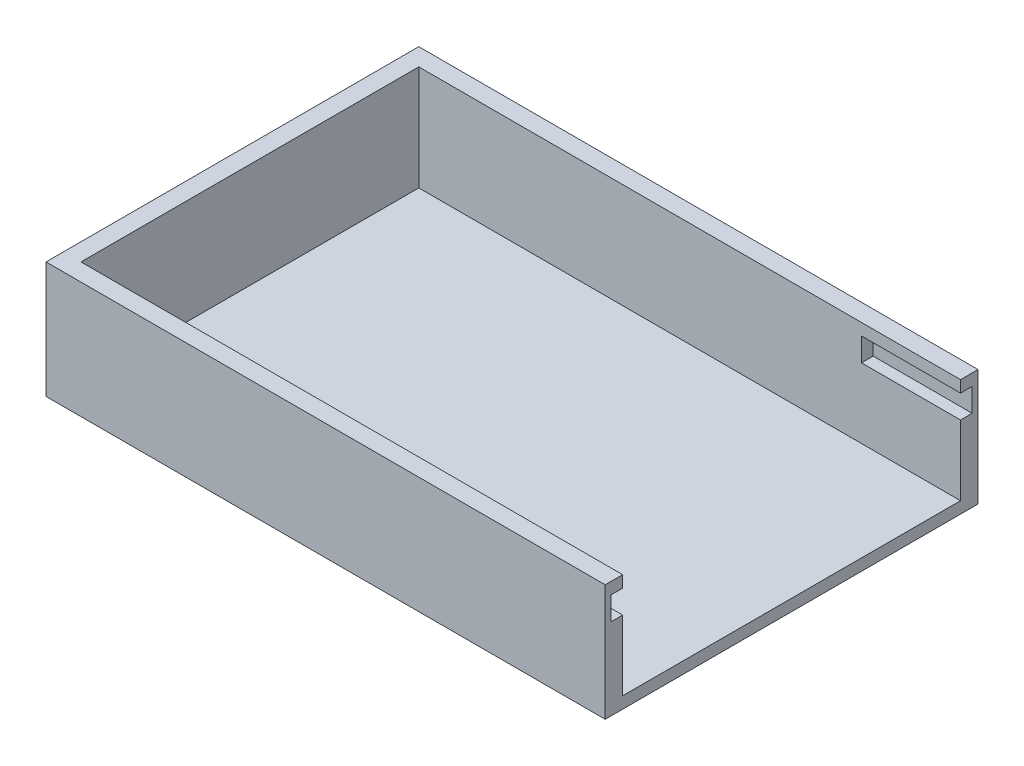
ISO-10303-21;
HEADER;
FILE_DESCRIPTION(('STEP AP214'),'2;1');
FILE_NAME('part.step','',(''),(''),'','','');
FILE_SCHEMA(('AUTOMOTIVE_DESIGN { 1 0 10303 214 1 1 1 1 }'));
ENDSEC;
DATA;
#1=APPLICATION_CONTEXT('core data for automotive mechanical design processes');
#2=APPLICATION_PROTOCOL_DEFINITION('international standard','automotive_design',2000,#1);
#3=PRODUCT_CONTEXT('',#1,'mechanical');
#4=PRODUCT('Part','Part','',(#3));
#5=PRODUCT_RELATED_PRODUCT_CATEGORY('part','',(#4));
#6=PRODUCT_DEFINITION_FORMATION('','',#4);
#7=PRODUCT_DEFINITION_CONTEXT('part definition',#1,'design');
#8=PRODUCT_DEFINITION('design','',#6,#7);
#9=PRODUCT_DEFINITION_SHAPE('','',#8);
#10=(LENGTH_UNIT() NAMED_UNIT(*) SI_UNIT(.MILLI.,.METRE.));
#11=(NAMED_UNIT(*) PLANE_ANGLE_UNIT() SI_UNIT($,.RADIAN.));
#12=(NAMED_UNIT(*) SI_UNIT($,.STERADIAN.) SOLID_ANGLE_UNIT());
#13=UNCERTAINTY_MEASURE_WITH_UNIT(LENGTH_MEASURE(1.E-05),#10,'distance_accuracy_value','');
#14=(GEOMETRIC_REPRESENTATION_CONTEXT(3) GLOBAL_UNCERTAINTY_ASSIGNED_CONTEXT((#13)) GLOBAL_UNIT_ASSIGNED_CONTEXT((#10,
#11,#12)) REPRESENTATION_CONTEXT('',''));
#15=CARTESIAN_POINT('',(0.,0.,0.));
#16=DIRECTION('',(0.,0.,1.));
#17=DIRECTION('',(1.,0.,0.));
#18=AXIS2_PLACEMENT_3D('',#15,#16,#17);
#19=CARTESIAN_POINT('',(-76.2,31.75,50.8));
#20=DIRECTION('',(1.,0.,0.));
#21=DIRECTION('',(0.,0.,-1.));
#22=AXIS2_PLACEMENT_3D('',#19,#20,#21);
#23=PLANE('',#22);
#24=DIRECTION('',(0.,0.,1.));
#25=VECTOR('',#24,1.);
#26=CARTESIAN_POINT('',(-76.2,0.,50.8));
#27=LINE('',#26,#25);
#28=CARTESIAN_POINT('',(-76.2,0.,-50.8));
#29=VERTEX_POINT('',#28);
#30=CARTESIAN_POINT('',(-76.2,0.,50.8));
#31=VERTEX_POINT('',#30);
#32=EDGE_CURVE('E250',#29,#31,#27,.T.);
#33=ORIENTED_EDGE('',*,*,#32,.T.);
#34=DIRECTION('',(0.,-1.,0.));
#35=VECTOR('',#34,1.);
#36=CARTESIAN_POINT('',(-76.2,31.75,50.8));
#37=LINE('',#36,#35);
#38=CARTESIAN_POINT('',(-76.2,31.75,50.8));
#39=VERTEX_POINT('',#38);
#40=EDGE_CURVE('E290',#39,#31,#37,.T.);
#41=ORIENTED_EDGE('',*,*,#40,.F.);
#42=DIRECTION('',(0.,0.,1.));
#43=VECTOR('',#42,1.);
#44=CARTESIAN_POINT('',(-76.2,31.75,50.8));
#45=LINE('',#44,#43);
#46=CARTESIAN_POINT('',(-76.2,31.75,-50.8));
#47=VERTEX_POINT('',#46);
#48=EDGE_CURVE('E251',#47,#39,#45,.T.);
#49=ORIENTED_EDGE('',*,*,#48,.F.);
#50=DIRECTION('',(0.,-1.,0.));
#51=VECTOR('',#50,1.);
#52=CARTESIAN_POINT('',(-76.2,31.75,-50.8));
#53=LINE('',#52,#51);
#54=EDGE_CURVE('E267',#47,#29,#53,.T.);
#55=ORIENTED_EDGE('',*,*,#54,.T.);
#56=EDGE_LOOP('',(#33,#41,#49,#55));
#57=FACE_BOUND('',#56,.T.);
#58=ADVANCED_FACE('F40',(#57),#23,.F.);
#59=CARTESIAN_POINT('',(76.2,31.75,50.8));
#60=DIRECTION('',(0.,0.,-1.));
#61=DIRECTION('',(-1.,0.,0.));
#62=AXIS2_PLACEMENT_3D('',#59,#60,#61);
#63=PLANE('',#62);
#64=DIRECTION('',(1.,0.,0.));
#65=VECTOR('',#64,1.);
#66=CARTESIAN_POINT('',(76.2,0.,50.8));
#67=LINE('',#66,#65);
#68=CARTESIAN_POINT('',(76.2,0.,50.8));
#69=VERTEX_POINT('',#68);
#70=EDGE_CURVE('E271',#31,#69,#67,.T.);
#71=ORIENTED_EDGE('',*,*,#70,.T.);
#72=DIRECTION('',(0.,-1.,0.));
#73=VECTOR('',#72,1.);
#74=CARTESIAN_POINT('',(76.2,31.75,50.8));
#75=LINE('',#74,#73);
#76=CARTESIAN_POINT('',(76.2,31.75,50.8));
#77=VERTEX_POINT('',#76);
#78=EDGE_CURVE('E286',#77,#69,#75,.T.);
#79=ORIENTED_EDGE('',*,*,#78,.F.);
#80=DIRECTION('',(1.,0.,0.));
#81=VECTOR('',#80,1.);
#82=CARTESIAN_POINT('',(76.2,31.75,50.8));
#83=LINE('',#82,#81);
#84=EDGE_CURVE('E255',#39,#77,#83,.T.);
#85=ORIENTED_EDGE('',*,*,#84,.F.);
#86=ORIENTED_EDGE('',*,*,#40,.T.);
#87=EDGE_LOOP('',(#71,#79,#85,#86));
#88=FACE_BOUND('',#87,.T.);
#89=ADVANCED_FACE('F343',(#88),#63,.F.);
#90=CARTESIAN_POINT('',(76.2,31.75,50.8));
#91=DIRECTION('',(-1.,0.,0.));
#92=DIRECTION('',(0.,0.,1.));
#93=AXIS2_PLACEMENT_3D('',#90,#91,#92);
#94=PLANE('',#93);
#95=DIRECTION('',(0.,1.,0.));
#96=VECTOR('',#95,1.);
#97=CARTESIAN_POINT('',(76.2,31.75,46.0375));
#98=LINE('',#97,#96);
#99=CARTESIAN_POINT('',(76.2,3.17500000000001,46.0375));
#100=VERTEX_POINT('',#99);
#101=CARTESIAN_POINT('',(76.2,22.225,46.0375));
#102=VERTEX_POINT('',#101);
#103=EDGE_CURVE('E241',#100,#102,#98,.T.);
#104=ORIENTED_EDGE('',*,*,#103,.T.);
#105=DIRECTION('',(0.,0.,-1.));
#106=VECTOR('',#105,1.);
#107=CARTESIAN_POINT('',(76.2,22.225,49.2125));
#108=LINE('',#107,#106);
#109=CARTESIAN_POINT('',(76.2,22.225,49.2125));
#110=VERTEX_POINT('',#109);
#111=EDGE_CURVE('E180',#110,#102,#108,.T.);
#112=ORIENTED_EDGE('',*,*,#111,.F.);
#113=DIRECTION('',(0.,-1.,0.));
#114=VECTOR('',#113,1.);
#115=CARTESIAN_POINT('',(76.2,28.575,49.2125));
#116=LINE('',#115,#114);
#117=CARTESIAN_POINT('',(76.2,28.575,49.2125));
#118=VERTEX_POINT('',#117);
#119=EDGE_CURVE('E186',#118,#110,#116,.T.);
#120=ORIENTED_EDGE('',*,*,#119,.F.);
#121=DIRECTION('',(0.,0.,1.));
#122=VECTOR('',#121,1.);
#123=CARTESIAN_POINT('',(76.2,28.575,44.45));
#124=LINE('',#123,#122);
#125=CARTESIAN_POINT('',(76.2,28.575,46.0375));
#126=VERTEX_POINT('',#125);
#127=EDGE_CURVE('E168',#126,#118,#124,.T.);
#128=ORIENTED_EDGE('',*,*,#127,.F.);
#129=CARTESIAN_POINT('',(76.2,31.75,46.0375));
#130=VERTEX_POINT('',#129);
#131=EDGE_CURVE('E240',#126,#130,#98,.T.);
#132=ORIENTED_EDGE('',*,*,#131,.T.);
#133=DIRECTION('',(0.,0.,-1.));
#134=VECTOR('',#133,1.);
#135=CARTESIAN_POINT('',(76.2,31.75,50.8));
#136=LINE('',#135,#134);
#137=EDGE_CURVE('E260',#77,#130,#136,.T.);
#138=ORIENTED_EDGE('',*,*,#137,.F.);
#139=ORIENTED_EDGE('',*,*,#78,.T.);
#140=DIRECTION('',(0.,0.,-1.));
#141=VECTOR('',#140,1.);
#142=CARTESIAN_POINT('',(76.2,0.,50.8));
#143=LINE('',#142,#141);
#144=CARTESIAN_POINT('',(76.2,0.,-50.8));
#145=VERTEX_POINT('',#144);
#146=EDGE_CURVE('E274',#69,#145,#143,.T.);
#147=ORIENTED_EDGE('',*,*,#146,.T.);
#148=DIRECTION('',(0.,-1.,0.));
#149=VECTOR('',#148,1.);
#150=CARTESIAN_POINT('',(76.2,31.75,-50.8));
#151=LINE('',#150,#149);
#152=CARTESIAN_POINT('',(76.2,31.75,-50.8));
#153=VERTEX_POINT('',#152);
#154=EDGE_CURVE('E282',#153,#145,#151,.T.);
#155=ORIENTED_EDGE('',*,*,#154,.F.);
#156=CARTESIAN_POINT('',(76.2,31.75,-46.0375));
#157=VERTEX_POINT('',#156);
#158=EDGE_CURVE('E259',#157,#153,#136,.T.);
#159=ORIENTED_EDGE('',*,*,#158,.F.);
#160=DIRECTION('',(0.,-1.,0.));
#161=VECTOR('',#160,1.);
#162=CARTESIAN_POINT('',(76.2,31.75,-46.0375));
#163=LINE('',#162,#161);
#164=CARTESIAN_POINT('',(76.2,28.575,-46.0375));
#165=VERTEX_POINT('',#164);
#166=EDGE_CURVE('E246',#157,#165,#163,.T.);
#167=ORIENTED_EDGE('',*,*,#166,.T.);
#168=DIRECTION('',(0.,0.,1.));
#169=VECTOR('',#168,1.);
#170=CARTESIAN_POINT('',(76.2,28.575,-49.2125));
#171=LINE('',#170,#169);
#172=CARTESIAN_POINT('',(76.2,28.575,-49.2125));
#173=VERTEX_POINT('',#172);
#174=EDGE_CURVE('E202',#173,#165,#171,.T.);
#175=ORIENTED_EDGE('',*,*,#174,.F.);
#176=DIRECTION('',(0.,1.,0.));
#177=VECTOR('',#176,1.);
#178=CARTESIAN_POINT('',(76.2,22.225,-49.2125));
#179=LINE('',#178,#177);
#180=CARTESIAN_POINT('',(76.2,22.225,-49.2125));
#181=VERTEX_POINT('',#180);
#182=EDGE_CURVE('E195',#181,#173,#179,.T.);
#183=ORIENTED_EDGE('',*,*,#182,.F.);
#184=DIRECTION('',(0.,0.,-1.));
#185=VECTOR('',#184,1.);
#186=CARTESIAN_POINT('',(76.2,22.225,-44.45));
#187=LINE('',#186,#185);
#188=CARTESIAN_POINT('',(76.2,22.225,-46.0375));
#189=VERTEX_POINT('',#188);
#190=EDGE_CURVE('E205',#189,#181,#187,.T.);
#191=ORIENTED_EDGE('',*,*,#190,.F.);
#192=CARTESIAN_POINT('',(76.2,3.17500000000001,-46.0375));
#193=VERTEX_POINT('',#192);
#194=EDGE_CURVE('E245',#189,#193,#163,.T.);
#195=ORIENTED_EDGE('',*,*,#194,.T.);
#196=DIRECTION('',(0.,0.,-1.));
#197=VECTOR('',#196,1.);
#198=CARTESIAN_POINT('',(76.2,3.175,50.8));
#199=LINE('',#198,#197);
#200=EDGE_CURVE('E297',#100,#193,#199,.T.);
#201=ORIENTED_EDGE('',*,*,#200,.F.);
#202=EDGE_LOOP('',(#104,#112,#120,#128,#132,#138,#139,#147,#155,#159,#167,#175,#183,#191,#195,#201));
#203=FACE_BOUND('',#202,.T.);
#204=ADVANCED_FACE('F325',(#203),#94,.F.);
#205=CARTESIAN_POINT('',(76.2,31.75,-50.8));
#206=DIRECTION('',(0.,0.,1.));
#207=DIRECTION('',(1.,0.,0.));
#208=AXIS2_PLACEMENT_3D('',#205,#206,#207);
#209=PLANE('',#208);
#210=DIRECTION('',(-1.,0.,0.));
#211=VECTOR('',#210,1.);
#212=CARTESIAN_POINT('',(76.2,0.,-50.8));
#213=LINE('',#212,#211);
#214=EDGE_CURVE('E256',#145,#29,#213,.T.);
#215=ORIENTED_EDGE('',*,*,#214,.T.);
#216=ORIENTED_EDGE('',*,*,#54,.F.);
#217=DIRECTION('',(-1.,0.,0.));
#218=VECTOR('',#217,1.);
#219=CARTESIAN_POINT('',(76.2,31.75,-50.8));
#220=LINE('',#219,#218);
#221=EDGE_CURVE('E264',#153,#47,#220,.T.);
#222=ORIENTED_EDGE('',*,*,#221,.F.);
#223=ORIENTED_EDGE('',*,*,#154,.T.);
#224=EDGE_LOOP('',(#215,#216,#222,#223));
#225=FACE_BOUND('',#224,.T.);
#226=ADVANCED_FACE('F366',(#225),#209,.F.);
#227=CARTESIAN_POINT('',(0.,31.75,0.));
#228=DIRECTION('',(0.,1.,0.));
#229=DIRECTION('',(0.,0.,1.));
#230=AXIS2_PLACEMENT_3D('',#227,#228,#229);
#231=PLANE('',#230);
#232=DIRECTION('',(-1.,0.,0.));
#233=VECTOR('',#232,1.);
#234=CARTESIAN_POINT('',(0.,31.75,-46.0375));
#235=LINE('',#234,#233);
#236=CARTESIAN_POINT('',(-71.4375,31.75,-46.0375));
#237=VERTEX_POINT('',#236);
#238=EDGE_CURVE('E294',#157,#237,#235,.T.);
#239=ORIENTED_EDGE('',*,*,#238,.F.);
#240=ORIENTED_EDGE('',*,*,#158,.T.);
#241=ORIENTED_EDGE('',*,*,#221,.T.);
#242=ORIENTED_EDGE('',*,*,#48,.T.);
#243=ORIENTED_EDGE('',*,*,#84,.T.);
#244=ORIENTED_EDGE('',*,*,#137,.T.);
#245=DIRECTION('',(1.,0.,0.));
#246=VECTOR('',#245,1.);
#247=CARTESIAN_POINT('',(80.9625,31.75,46.0375));
#248=LINE('',#247,#246);
#249=CARTESIAN_POINT('',(-71.4375,31.75,46.0375));
#250=VERTEX_POINT('',#249);
#251=EDGE_CURVE('E227',#250,#130,#248,.T.);
#252=ORIENTED_EDGE('',*,*,#251,.F.);
#253=DIRECTION('',(0.,0.,1.));
#254=VECTOR('',#253,1.);
#255=CARTESIAN_POINT('',(-71.4375,31.75,46.0375));
#256=LINE('',#255,#254);
#257=EDGE_CURVE('E190',#237,#250,#256,.T.);
#258=ORIENTED_EDGE('',*,*,#257,.F.);
#259=EDGE_LOOP('',(#239,#240,#241,#242,#243,#244,#252,#258));
#260=FACE_BOUND('',#259,.T.);
#261=ADVANCED_FACE('F361',(#260),#231,.T.);
#262=CARTESIAN_POINT('',(0.,0.,0.));
#263=DIRECTION('',(0.,1.,0.));
#264=DIRECTION('',(0.,0.,1.));
#265=AXIS2_PLACEMENT_3D('',#262,#263,#264);
#266=PLANE('',#265);
#267=ORIENTED_EDGE('',*,*,#32,.F.);
#268=ORIENTED_EDGE('',*,*,#214,.F.);
#269=ORIENTED_EDGE('',*,*,#146,.F.);
#270=ORIENTED_EDGE('',*,*,#70,.F.);
#271=EDGE_LOOP('',(#267,#268,#269,#270));
#272=FACE_BOUND('',#271,.T.);
#273=ADVANCED_FACE('F355',(#272),#266,.F.);
#274=CARTESIAN_POINT('',(0.,3.175,0.));
#275=DIRECTION('',(0.,1.,0.));
#276=DIRECTION('',(0.,0.,1.));
#277=AXIS2_PLACEMENT_3D('',#274,#275,#276);
#278=PLANE('',#277);
#279=ORIENTED_EDGE('',*,*,#200,.T.);
#280=DIRECTION('',(1.,0.,0.));
#281=VECTOR('',#280,1.);
#282=CARTESIAN_POINT('',(71.4375,3.17500000000001,-46.0375));
#283=LINE('',#282,#281);
#284=CARTESIAN_POINT('',(-71.4375,3.17500000000001,-46.0375));
#285=VERTEX_POINT('',#284);
#286=EDGE_CURVE('E216',#285,#193,#283,.T.);
#287=ORIENTED_EDGE('',*,*,#286,.F.);
#288=DIRECTION('',(0.,0.,-1.));
#289=VECTOR('',#288,1.);
#290=CARTESIAN_POINT('',(-71.4375,3.17500000000001,46.0375));
#291=LINE('',#290,#289);
#292=CARTESIAN_POINT('',(-71.4375,3.17500000000001,46.0375));
#293=VERTEX_POINT('',#292);
#294=EDGE_CURVE('E220',#293,#285,#291,.T.);
#295=ORIENTED_EDGE('',*,*,#294,.F.);
#296=DIRECTION('',(-1.,0.,0.));
#297=VECTOR('',#296,1.);
#298=CARTESIAN_POINT('',(80.9625,3.17500000000001,46.0375));
#299=LINE('',#298,#297);
#300=EDGE_CURVE('E224',#100,#293,#299,.T.);
#301=ORIENTED_EDGE('',*,*,#300,.F.);
#302=EDGE_LOOP('',(#279,#287,#295,#301));
#303=FACE_BOUND('',#302,.T.);
#304=ADVANCED_FACE('F387',(#303),#278,.T.);
#305=CARTESIAN_POINT('',(71.4375,-178.054951138686,-46.0375));
#306=DIRECTION('',(0.,0.,-1.));
#307=DIRECTION('',(-1.,0.,0.));
#308=AXIS2_PLACEMENT_3D('',#305,#306,#307);
#309=PLANE('',#308);
#310=DIRECTION('',(0.,-1.,0.));
#311=VECTOR('',#310,1.);
#312=CARTESIAN_POINT('',(49.2125,-178.054951138686,-46.0375));
#313=LINE('',#312,#311);
#314=CARTESIAN_POINT('',(49.2125,28.575,-46.0375));
#315=VERTEX_POINT('',#314);
#316=CARTESIAN_POINT('',(49.2125,22.225,-46.0375));
#317=VERTEX_POINT('',#316);
#318=EDGE_CURVE('E310',#315,#317,#313,.T.);
#319=ORIENTED_EDGE('',*,*,#318,.F.);
#320=DIRECTION('',(1.,0.,0.));
#321=VECTOR('',#320,1.);
#322=CARTESIAN_POINT('',(71.4375,28.575,-46.0375));
#323=LINE('',#322,#321);
#324=EDGE_CURVE('E12',#315,#165,#323,.T.);
#325=ORIENTED_EDGE('',*,*,#324,.T.);
#326=ORIENTED_EDGE('',*,*,#166,.F.);
#327=ORIENTED_EDGE('',*,*,#238,.T.);
#328=DIRECTION('',(0.,1.,0.));
#329=VECTOR('',#328,1.);
#330=CARTESIAN_POINT('',(-71.4375,-178.054951138686,-46.0375));
#331=LINE('',#330,#329);
#332=EDGE_CURVE('E221',#285,#237,#331,.T.);
#333=ORIENTED_EDGE('',*,*,#332,.F.);
#334=ORIENTED_EDGE('',*,*,#286,.T.);
#335=ORIENTED_EDGE('',*,*,#194,.F.);
#336=DIRECTION('',(-1.,0.,0.));
#337=VECTOR('',#336,1.);
#338=CARTESIAN_POINT('',(71.4375,22.225,-46.0375));
#339=LINE('',#338,#337);
#340=EDGE_CURVE('E48',#189,#317,#339,.T.);
#341=ORIENTED_EDGE('',*,*,#340,.T.);
#342=EDGE_LOOP('',(#319,#325,#326,#327,#333,#334,#335,#341));
#343=FACE_BOUND('',#342,.T.);
#344=ADVANCED_FACE('F317',(#343),#309,.F.);
#345=CARTESIAN_POINT('',(80.9625,-178.054951138686,46.0375));
#346=DIRECTION('',(0.,0.,1.));
#347=DIRECTION('',(1.,0.,0.));
#348=AXIS2_PLACEMENT_3D('',#345,#346,#347);
#349=PLANE('',#348);
#350=DIRECTION('',(0.,1.,0.));
#351=VECTOR('',#350,1.);
#352=CARTESIAN_POINT('',(49.2125,-178.054951138686,46.0375));
#353=LINE('',#352,#351);
#354=CARTESIAN_POINT('',(49.2125,22.225,46.0375));
#355=VERTEX_POINT('',#354);
#356=CARTESIAN_POINT('',(49.2125,28.575,46.0375));
#357=VERTEX_POINT('',#356);
#358=EDGE_CURVE('E159',#355,#357,#353,.T.);
#359=ORIENTED_EDGE('',*,*,#358,.F.);
#360=DIRECTION('',(1.,0.,0.));
#361=VECTOR('',#360,1.);
#362=CARTESIAN_POINT('',(80.9625,22.225,46.0375));
#363=LINE('',#362,#361);
#364=EDGE_CURVE('E306',#355,#102,#363,.T.);
#365=ORIENTED_EDGE('',*,*,#364,.T.);
#366=ORIENTED_EDGE('',*,*,#103,.F.);
#367=ORIENTED_EDGE('',*,*,#300,.T.);
#368=DIRECTION('',(0.,1.,0.));
#369=VECTOR('',#368,1.);
#370=CARTESIAN_POINT('',(-71.4375,-178.054951138686,46.0375));
#371=LINE('',#370,#369);
#372=EDGE_CURVE('E231',#293,#250,#371,.T.);
#373=ORIENTED_EDGE('',*,*,#372,.T.);
#374=ORIENTED_EDGE('',*,*,#251,.T.);
#375=ORIENTED_EDGE('',*,*,#131,.F.);
#376=DIRECTION('',(-1.,0.,0.));
#377=VECTOR('',#376,1.);
#378=CARTESIAN_POINT('',(80.9625,28.575,46.0375));
#379=LINE('',#378,#377);
#380=EDGE_CURVE('E303',#126,#357,#379,.T.);
#381=ORIENTED_EDGE('',*,*,#380,.T.);
#382=EDGE_LOOP('',(#359,#365,#366,#367,#373,#374,#375,#381));
#383=FACE_BOUND('',#382,.T.);
#384=ADVANCED_FACE('F371',(#383),#349,.F.);
#385=CARTESIAN_POINT('',(-71.4375,-178.054951138686,46.0375));
#386=DIRECTION('',(-1.,0.,0.));
#387=DIRECTION('',(0.,0.,1.));
#388=AXIS2_PLACEMENT_3D('',#385,#386,#387);
#389=PLANE('',#388);
#390=ORIENTED_EDGE('',*,*,#294,.T.);
#391=ORIENTED_EDGE('',*,*,#332,.T.);
#392=ORIENTED_EDGE('',*,*,#257,.T.);
#393=ORIENTED_EDGE('',*,*,#372,.F.);
#394=EDGE_LOOP('',(#390,#391,#392,#393));
#395=FACE_BOUND('',#394,.T.);
#396=ADVANCED_FACE('F376',(#395),#389,.F.);
#397=CARTESIAN_POINT('',(49.2125,22.225,49.2125));
#398=DIRECTION('',(0.,-1.,0.));
#399=DIRECTION('',(0.,0.,-1.));
#400=AXIS2_PLACEMENT_3D('',#397,#398,#399);
#401=PLANE('',#400);
#402=DIRECTION('',(0.,0.,-1.));
#403=VECTOR('',#402,1.);
#404=CARTESIAN_POINT('',(49.2125,22.225,49.2125));
#405=LINE('',#404,#403);
#406=CARTESIAN_POINT('',(49.2125,22.225,49.2125));
#407=VERTEX_POINT('',#406);
#408=EDGE_CURVE('E63',#407,#355,#405,.T.);
#409=ORIENTED_EDGE('',*,*,#408,.F.);
#410=DIRECTION('',(1.,0.,0.));
#411=VECTOR('',#410,1.);
#412=CARTESIAN_POINT('',(49.2125,22.225,49.2125));
#413=LINE('',#412,#411);
#414=EDGE_CURVE('E173',#407,#110,#413,.T.);
#415=ORIENTED_EDGE('',*,*,#414,.T.);
#416=ORIENTED_EDGE('',*,*,#111,.T.);
#417=ORIENTED_EDGE('',*,*,#364,.F.);
#418=EDGE_LOOP('',(#409,#415,#416,#417));
#419=FACE_BOUND('',#418,.T.);
#420=ADVANCED_FACE('F397',(#419),#401,.F.);
#421=CARTESIAN_POINT('',(49.2125,28.575,44.45));
#422=DIRECTION('',(0.,1.,0.));
#423=DIRECTION('',(0.,0.,1.));
#424=AXIS2_PLACEMENT_3D('',#421,#422,#423);
#425=PLANE('',#424);
#426=ORIENTED_EDGE('',*,*,#127,.T.);
#427=DIRECTION('',(1.,0.,0.));
#428=VECTOR('',#427,1.);
#429=CARTESIAN_POINT('',(49.2125,28.575,49.2125));
#430=LINE('',#429,#428);
#431=CARTESIAN_POINT('',(49.2125,28.575,49.2125));
#432=VERTEX_POINT('',#431);
#433=EDGE_CURVE('E165',#432,#118,#430,.T.);
#434=ORIENTED_EDGE('',*,*,#433,.F.);
#435=DIRECTION('',(0.,0.,1.));
#436=VECTOR('',#435,1.);
#437=CARTESIAN_POINT('',(49.2125,28.575,44.45));
#438=LINE('',#437,#436);
#439=EDGE_CURVE('E153',#357,#432,#438,.T.);
#440=ORIENTED_EDGE('',*,*,#439,.F.);
#441=ORIENTED_EDGE('',*,*,#380,.F.);
#442=EDGE_LOOP('',(#426,#434,#440,#441));
#443=FACE_BOUND('',#442,.T.);
#444=ADVANCED_FACE('F166',(#443),#425,.F.);
#445=CARTESIAN_POINT('',(49.2125,0.,0.));
#446=DIRECTION('',(1.,0.,0.));
#447=DIRECTION('',(0.,0.,-1.));
#448=AXIS2_PLACEMENT_3D('',#445,#446,#447);
#449=PLANE('',#448);
#450=ORIENTED_EDGE('',*,*,#358,.T.);
#451=ORIENTED_EDGE('',*,*,#439,.T.);
#452=DIRECTION('',(0.,-1.,0.));
#453=VECTOR('',#452,1.);
#454=CARTESIAN_POINT('',(49.2125,28.575,49.2125));
#455=LINE('',#454,#453);
#456=EDGE_CURVE('E157',#432,#407,#455,.T.);
#457=ORIENTED_EDGE('',*,*,#456,.T.);
#458=ORIENTED_EDGE('',*,*,#408,.T.);
#459=EDGE_LOOP('',(#450,#451,#457,#458));
#460=FACE_BOUND('',#459,.T.);
#461=ADVANCED_FACE('F155',(#460),#449,.T.);
#462=CARTESIAN_POINT('',(49.2125,28.575,49.2125));
#463=DIRECTION('',(0.,0.,1.));
#464=DIRECTION('',(1.,0.,0.));
#465=AXIS2_PLACEMENT_3D('',#462,#463,#464);
#466=PLANE('',#465);
#467=ORIENTED_EDGE('',*,*,#119,.T.);
#468=ORIENTED_EDGE('',*,*,#414,.F.);
#469=ORIENTED_EDGE('',*,*,#456,.F.);
#470=ORIENTED_EDGE('',*,*,#433,.T.);
#471=EDGE_LOOP('',(#467,#468,#469,#470));
#472=FACE_BOUND('',#471,.T.);
#473=ADVANCED_FACE('F175',(#472),#466,.F.);
#474=CARTESIAN_POINT('',(49.2125,28.575,-49.2125));
#475=DIRECTION('',(0.,1.,0.));
#476=DIRECTION('',(0.,0.,1.));
#477=AXIS2_PLACEMENT_3D('',#474,#475,#476);
#478=PLANE('',#477);
#479=DIRECTION('',(0.,0.,1.));
#480=VECTOR('',#479,1.);
#481=CARTESIAN_POINT('',(49.2125,28.575,-49.2125));
#482=LINE('',#481,#480);
#483=CARTESIAN_POINT('',(49.2125,28.575,-49.2125));
#484=VERTEX_POINT('',#483);
#485=EDGE_CURVE('E55',#484,#315,#482,.T.);
#486=ORIENTED_EDGE('',*,*,#485,.F.);
#487=DIRECTION('',(1.,0.,0.));
#488=VECTOR('',#487,1.);
#489=CARTESIAN_POINT('',(49.2125,28.575,-49.2125));
#490=LINE('',#489,#488);
#491=EDGE_CURVE('E183',#484,#173,#490,.T.);
#492=ORIENTED_EDGE('',*,*,#491,.T.);
#493=ORIENTED_EDGE('',*,*,#174,.T.);
#494=ORIENTED_EDGE('',*,*,#324,.F.);
#495=EDGE_LOOP('',(#486,#492,#493,#494));
#496=FACE_BOUND('',#495,.T.);
#497=ADVANCED_FACE('F339',(#496),#478,.F.);
#498=CARTESIAN_POINT('',(49.2125,22.225,-44.45));
#499=DIRECTION('',(0.,-1.,0.));
#500=DIRECTION('',(0.,0.,-1.));
#501=AXIS2_PLACEMENT_3D('',#498,#499,#500);
#502=PLANE('',#501);
#503=ORIENTED_EDGE('',*,*,#190,.T.);
#504=DIRECTION('',(1.,0.,0.));
#505=VECTOR('',#504,1.);
#506=CARTESIAN_POINT('',(49.2125,22.225,-49.2125));
#507=LINE('',#506,#505);
#508=CARTESIAN_POINT('',(49.2125,22.225,-49.2125));
#509=VERTEX_POINT('',#508);
#510=EDGE_CURVE('E201',#509,#181,#507,.T.);
#511=ORIENTED_EDGE('',*,*,#510,.F.);
#512=DIRECTION('',(0.,0.,-1.));
#513=VECTOR('',#512,1.);
#514=CARTESIAN_POINT('',(49.2125,22.225,-44.45));
#515=LINE('',#514,#513);
#516=EDGE_CURVE('E194',#317,#509,#515,.T.);
#517=ORIENTED_EDGE('',*,*,#516,.F.);
#518=ORIENTED_EDGE('',*,*,#340,.F.);
#519=EDGE_LOOP('',(#503,#511,#517,#518));
#520=FACE_BOUND('',#519,.T.);
#521=ADVANCED_FACE('F321',(#520),#502,.F.);
#522=CARTESIAN_POINT('',(49.2125,0.,0.));
#523=DIRECTION('',(1.,0.,0.));
#524=DIRECTION('',(0.,0.,-1.));
#525=AXIS2_PLACEMENT_3D('',#522,#523,#524);
#526=PLANE('',#525);
#527=ORIENTED_EDGE('',*,*,#318,.T.);
#528=ORIENTED_EDGE('',*,*,#516,.T.);
#529=DIRECTION('',(0.,1.,0.));
#530=VECTOR('',#529,1.);
#531=CARTESIAN_POINT('',(49.2125,22.225,-49.2125));
#532=LINE('',#531,#530);
#533=EDGE_CURVE('E198',#509,#484,#532,.T.);
#534=ORIENTED_EDGE('',*,*,#533,.T.);
#535=ORIENTED_EDGE('',*,*,#485,.T.);
#536=EDGE_LOOP('',(#527,#528,#534,#535));
#537=FACE_BOUND('',#536,.T.);
#538=ADVANCED_FACE('F331',(#537),#526,.T.);
#539=CARTESIAN_POINT('',(49.2125,22.225,-49.2125));
#540=DIRECTION('',(0.,0.,-1.));
#541=DIRECTION('',(-1.,0.,0.));
#542=AXIS2_PLACEMENT_3D('',#539,#540,#541);
#543=PLANE('',#542);
#544=ORIENTED_EDGE('',*,*,#182,.T.);
#545=ORIENTED_EDGE('',*,*,#491,.F.);
#546=ORIENTED_EDGE('',*,*,#533,.F.);
#547=ORIENTED_EDGE('',*,*,#510,.T.);
#548=EDGE_LOOP('',(#544,#545,#546,#547));
#549=FACE_BOUND('',#548,.T.);
#550=ADVANCED_FACE('F329',(#549),#543,.F.);
#551=CLOSED_SHELL('',(#58,#89,#204,#226,#261,#273,#304,#344,#384,#396,#420,#444,#461,#473,#497,
#521,#538,#550));
#552=MANIFOLD_SOLID_BREP('B2',#551);
#553=ADVANCED_BREP_SHAPE_REPRESENTATION('',(#18,#552),#14);
#554=SHAPE_DEFINITION_REPRESENTATION(#9,#553);
ENDSEC;
END-ISO-10303-21;
